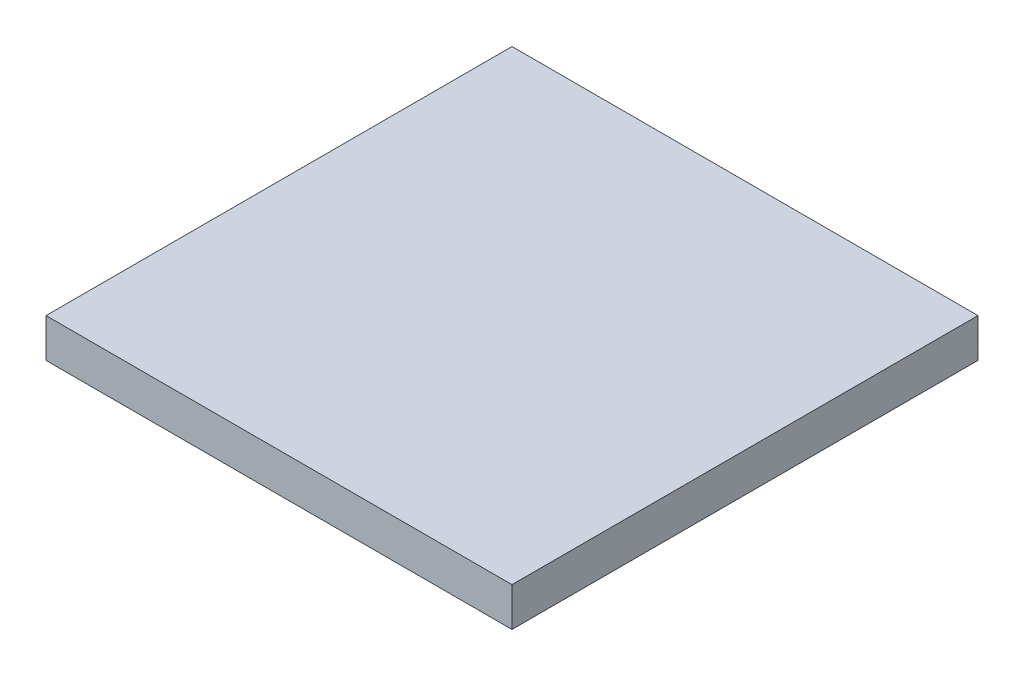
ISO-10303-21;
HEADER;
FILE_DESCRIPTION(('STEP AP214'),'2;1');
FILE_NAME('part.step','',(''),(''),'','','');
FILE_SCHEMA(('AUTOMOTIVE_DESIGN { 1 0 10303 214 1 1 1 1 }'));
ENDSEC;
DATA;
#1=APPLICATION_CONTEXT('core data for automotive mechanical design processes');
#2=APPLICATION_PROTOCOL_DEFINITION('international standard','automotive_design',2000,#1);
#3=PRODUCT_CONTEXT('',#1,'mechanical');
#4=PRODUCT('Part','Part','',(#3));
#5=PRODUCT_RELATED_PRODUCT_CATEGORY('part','',(#4));
#6=PRODUCT_DEFINITION_FORMATION('','',#4);
#7=PRODUCT_DEFINITION_CONTEXT('part definition',#1,'design');
#8=PRODUCT_DEFINITION('design','',#6,#7);
#9=PRODUCT_DEFINITION_SHAPE('','',#8);
#10=(LENGTH_UNIT() NAMED_UNIT(*) SI_UNIT(.MILLI.,.METRE.));
#11=(NAMED_UNIT(*) PLANE_ANGLE_UNIT() SI_UNIT($,.RADIAN.));
#12=(NAMED_UNIT(*) SI_UNIT($,.STERADIAN.) SOLID_ANGLE_UNIT());
#13=UNCERTAINTY_MEASURE_WITH_UNIT(LENGTH_MEASURE(1.E-05),#10,'distance_accuracy_value','');
#14=(GEOMETRIC_REPRESENTATION_CONTEXT(3) GLOBAL_UNCERTAINTY_ASSIGNED_CONTEXT((#13)) GLOBAL_UNIT_ASSIGNED_CONTEXT((#10,
#11,#12)) REPRESENTATION_CONTEXT('',''));
#15=CARTESIAN_POINT('',(0.,0.,0.));
#16=DIRECTION('',(0.,0.,1.));
#17=DIRECTION('',(1.,0.,0.));
#18=AXIS2_PLACEMENT_3D('',#15,#16,#17);
#19=CARTESIAN_POINT('',(6.50000000000649,-9.74999999998325,0.25000000002374));
#20=DIRECTION('',(1.,0.,0.));
#21=DIRECTION('',(0.,-1.07922929852104E-12,1.));
#22=AXIS2_PLACEMENT_3D('',#19,#20,#21);
#23=PLANE('',#22);
#24=DIRECTION('',(0.,1.,0.));
#25=VECTOR('',#24,1.);
#26=CARTESIAN_POINT('',(6.5,-9.74999999998325,6.25000000002374));
#27=LINE('',#26,#25);
#28=CARTESIAN_POINT('',(6.5,-9.74999999998325,6.25000000002374));
#29=VERTEX_POINT('',#28);
#30=CARTESIAN_POINT('',(6.5,-8.74999999998325,6.25000000002374));
#31=VERTEX_POINT('',#30);
#32=EDGE_CURVE('E40',#29,#31,#27,.T.);
#33=ORIENTED_EDGE('',*,*,#32,.F.);
#34=DIRECTION('',(1.07922929852104E-12,0.,-1.));
#35=VECTOR('',#34,1.);
#36=CARTESIAN_POINT('',(6.5,-9.74999999998325,6.25000000002374));
#37=LINE('',#36,#35);
#38=CARTESIAN_POINT('',(6.50000000001296,-9.74999999998325,-5.74999999997626));
#39=VERTEX_POINT('',#38);
#40=EDGE_CURVE('E11',#29,#39,#37,.T.);
#41=ORIENTED_EDGE('',*,*,#40,.T.);
#42=DIRECTION('',(0.,-1.,0.));
#43=VECTOR('',#42,1.);
#44=CARTESIAN_POINT('',(6.50000000001296,-8.74999999998325,-5.74999999997626));
#45=LINE('',#44,#43);
#46=CARTESIAN_POINT('',(6.50000000001296,-8.74999999998325,-5.74999999997626));
#47=VERTEX_POINT('',#46);
#48=EDGE_CURVE('E109',#47,#39,#45,.T.);
#49=ORIENTED_EDGE('',*,*,#48,.F.);
#50=DIRECTION('',(-1.07922929852104E-12,0.,1.));
#51=VECTOR('',#50,1.);
#52=CARTESIAN_POINT('',(6.50000000001296,-8.74999999998325,-5.74999999997626));
#53=LINE('',#52,#51);
#54=EDGE_CURVE('E28',#47,#31,#53,.T.);
#55=ORIENTED_EDGE('',*,*,#54,.T.);
#56=EDGE_LOOP('',(#33,#41,#49,#55));
#57=FACE_BOUND('',#56,.T.);
#58=ADVANCED_FACE('F17',(#57),#23,.T.);
#59=CARTESIAN_POINT('',(0.50000000000001,-9.74999999998325,6.25000000001727));
#60=DIRECTION('',(0.,0.,1.));
#61=DIRECTION('',(1.,1.07922929852104E-12,0.));
#62=AXIS2_PLACEMENT_3D('',#59,#60,#61);
#63=PLANE('',#62);
#64=DIRECTION('',(0.,-1.,0.));
#65=VECTOR('',#64,1.);
#66=CARTESIAN_POINT('',(-5.5,-8.74999999998325,6.25000000001079));
#67=LINE('',#66,#65);
#68=CARTESIAN_POINT('',(-5.5,-8.74999999998325,6.25000000001079));
#69=VERTEX_POINT('',#68);
#70=CARTESIAN_POINT('',(-5.5,-9.74999999998325,6.25000000001079));
#71=VERTEX_POINT('',#70);
#72=EDGE_CURVE('E77',#69,#71,#67,.T.);
#73=ORIENTED_EDGE('',*,*,#72,.T.);
#74=DIRECTION('',(1.,0.,1.07922929852104E-12));
#75=VECTOR('',#74,1.);
#76=CARTESIAN_POINT('',(-5.5,-9.74999999998325,6.25000000001079));
#77=LINE('',#76,#75);
#78=EDGE_CURVE('E68',#71,#29,#77,.T.);
#79=ORIENTED_EDGE('',*,*,#78,.T.);
#80=ORIENTED_EDGE('',*,*,#32,.T.);
#81=DIRECTION('',(-1.,0.,-1.07922929852104E-12));
#82=VECTOR('',#81,1.);
#83=CARTESIAN_POINT('',(6.5,-8.74999999998325,6.25000000002374));
#84=LINE('',#83,#82);
#85=EDGE_CURVE('E81',#31,#69,#84,.T.);
#86=ORIENTED_EDGE('',*,*,#85,.T.);
#87=EDGE_LOOP('',(#73,#79,#80,#86));
#88=FACE_BOUND('',#87,.T.);
#89=ADVANCED_FACE('F19',(#88),#63,.T.);
#90=CARTESIAN_POINT('',(-5.49999999999351,-9.74999999998325,0.25000000001079));
#91=DIRECTION('',(-1.,0.,-1.07922929852104E-12));
#92=DIRECTION('',(-1.07922929852104E-12,0.,1.));
#93=AXIS2_PLACEMENT_3D('',#90,#91,#92);
#94=PLANE('',#93);
#95=DIRECTION('',(0.,-1.,0.));
#96=VECTOR('',#95,1.);
#97=CARTESIAN_POINT('',(-5.49999999998704,-8.74999999998325,-5.74999999998921));
#98=LINE('',#97,#96);
#99=CARTESIAN_POINT('',(-5.49999999998704,-8.74999999998325,-5.74999999998921));
#100=VERTEX_POINT('',#99);
#101=CARTESIAN_POINT('',(-5.49999999998704,-9.74999999998325,-5.74999999998921));
#102=VERTEX_POINT('',#101);
#103=EDGE_CURVE('E88',#100,#102,#98,.T.);
#104=ORIENTED_EDGE('',*,*,#103,.T.);
#105=DIRECTION('',(-1.07922929852104E-12,0.,1.));
#106=VECTOR('',#105,1.);
#107=CARTESIAN_POINT('',(-5.49999999998704,-9.74999999998325,-5.74999999998921));
#108=LINE('',#107,#106);
#109=EDGE_CURVE('E73',#102,#71,#108,.T.);
#110=ORIENTED_EDGE('',*,*,#109,.T.);
#111=ORIENTED_EDGE('',*,*,#72,.F.);
#112=DIRECTION('',(1.07922929852104E-12,0.,-1.));
#113=VECTOR('',#112,1.);
#114=CARTESIAN_POINT('',(-5.5,-8.74999999998325,6.25000000001079));
#115=LINE('',#114,#113);
#116=EDGE_CURVE('E91',#69,#100,#115,.T.);
#117=ORIENTED_EDGE('',*,*,#116,.T.);
#118=EDGE_LOOP('',(#104,#110,#111,#117));
#119=FACE_BOUND('',#118,.T.);
#120=ADVANCED_FACE('F86',(#119),#94,.T.);
#121=CARTESIAN_POINT('',(-5.5,-8.74999999998325,0.250000000017266));
#122=DIRECTION('',(0.,1.,0.));
#123=DIRECTION('',(1.,0.,0.));
#124=AXIS2_PLACEMENT_3D('',#121,#122,#123);
#125=PLANE('',#124);
#126=ORIENTED_EDGE('',*,*,#85,.F.);
#127=ORIENTED_EDGE('',*,*,#54,.F.);
#128=DIRECTION('',(-1.,0.,-1.07922929852104E-12));
#129=VECTOR('',#128,1.);
#130=CARTESIAN_POINT('',(6.50000000001296,-8.74999999998325,-5.74999999997626));
#131=LINE('',#130,#129);
#132=EDGE_CURVE('E99',#47,#100,#131,.T.);
#133=ORIENTED_EDGE('',*,*,#132,.T.);
#134=ORIENTED_EDGE('',*,*,#116,.F.);
#135=EDGE_LOOP('',(#126,#127,#133,#134));
#136=FACE_BOUND('',#135,.T.);
#137=ADVANCED_FACE('F116',(#136),#125,.T.);
#138=CARTESIAN_POINT('',(0.50000000001296,-9.74999999998325,-5.74999999998274));
#139=DIRECTION('',(1.07922929852104E-12,0.,-1.));
#140=DIRECTION('',(0.,-1.,0.));
#141=AXIS2_PLACEMENT_3D('',#138,#139,#140);
#142=PLANE('',#141);
#143=ORIENTED_EDGE('',*,*,#48,.T.);
#144=DIRECTION('',(-1.,0.,-1.07922929852104E-12));
#145=VECTOR('',#144,1.);
#146=CARTESIAN_POINT('',(6.50000000001296,-9.74999999998325,-5.74999999997626));
#147=LINE('',#146,#145);
#148=EDGE_CURVE('E21',#39,#102,#147,.T.);
#149=ORIENTED_EDGE('',*,*,#148,.T.);
#150=ORIENTED_EDGE('',*,*,#103,.F.);
#151=ORIENTED_EDGE('',*,*,#132,.F.);
#152=EDGE_LOOP('',(#143,#149,#150,#151));
#153=FACE_BOUND('',#152,.T.);
#154=ADVANCED_FACE('F118',(#153),#142,.T.);
#155=CARTESIAN_POINT('',(0.500000000012961,-9.74999999998325,-5.74999999998274));
#156=DIRECTION('',(0.,-1.,0.));
#157=DIRECTION('',(0.,0.,-1.));
#158=AXIS2_PLACEMENT_3D('',#155,#156,#157);
#159=PLANE('',#158);
#160=ORIENTED_EDGE('',*,*,#148,.F.);
#161=ORIENTED_EDGE('',*,*,#40,.F.);
#162=ORIENTED_EDGE('',*,*,#78,.F.);
#163=ORIENTED_EDGE('',*,*,#109,.F.);
#164=EDGE_LOOP('',(#160,#161,#162,#163));
#165=FACE_BOUND('',#164,.T.);
#166=ADVANCED_FACE('F71',(#165),#159,.T.);
#167=CLOSED_SHELL('',(#58,#89,#120,#137,#154,#166));
#168=MANIFOLD_SOLID_BREP('B1',#167);
#169=ADVANCED_BREP_SHAPE_REPRESENTATION('',(#18,#168),#14);
#170=SHAPE_DEFINITION_REPRESENTATION(#9,#169);
ENDSEC;
END-ISO-10303-21;
